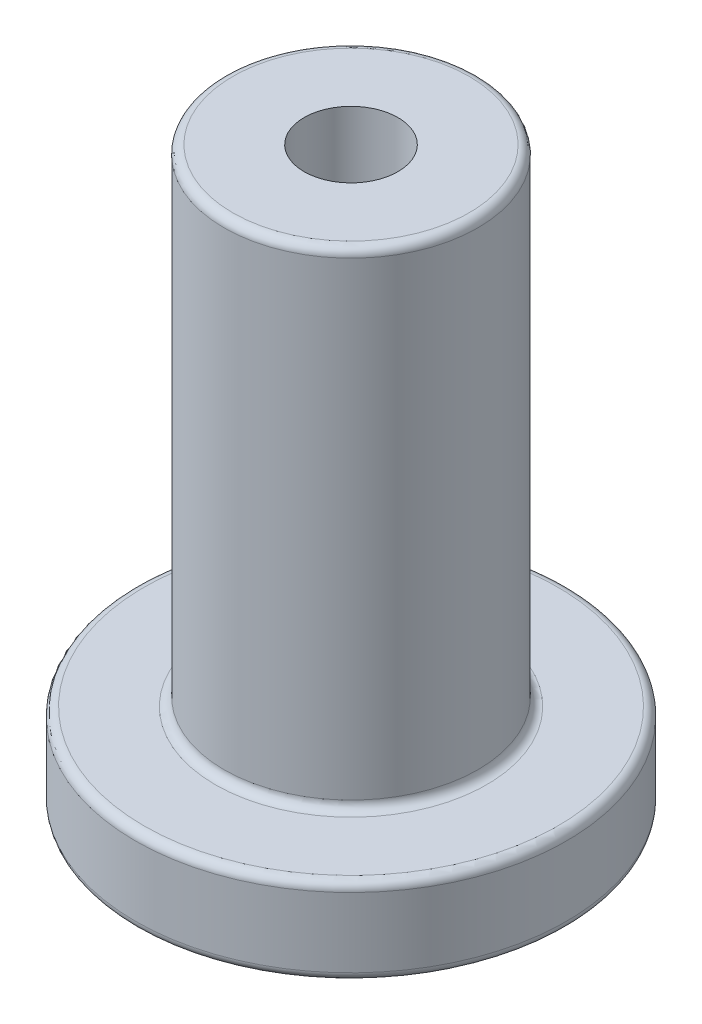
ISO-10303-21;
HEADER;
FILE_DESCRIPTION(('STEP AP214'),'2;1');
FILE_NAME('part.step','',(''),(''),'','','');
FILE_SCHEMA(('AUTOMOTIVE_DESIGN { 1 0 10303 214 1 1 1 1 }'));
ENDSEC;
DATA;
#1=APPLICATION_CONTEXT('core data for automotive mechanical design processes');
#2=APPLICATION_PROTOCOL_DEFINITION('international standard','automotive_design',2000,#1);
#3=PRODUCT_CONTEXT('',#1,'mechanical');
#4=PRODUCT('Part','Part','',(#3));
#5=PRODUCT_RELATED_PRODUCT_CATEGORY('part','',(#4));
#6=PRODUCT_DEFINITION_FORMATION('','',#4);
#7=PRODUCT_DEFINITION_CONTEXT('part definition',#1,'design');
#8=PRODUCT_DEFINITION('design','',#6,#7);
#9=PRODUCT_DEFINITION_SHAPE('','',#8);
#10=(LENGTH_UNIT() NAMED_UNIT(*) SI_UNIT(.MILLI.,.METRE.));
#11=(NAMED_UNIT(*) PLANE_ANGLE_UNIT() SI_UNIT($,.RADIAN.));
#12=(NAMED_UNIT(*) SI_UNIT($,.STERADIAN.) SOLID_ANGLE_UNIT());
#13=UNCERTAINTY_MEASURE_WITH_UNIT(LENGTH_MEASURE(1.E-05),#10,'distance_accuracy_value','');
#14=(GEOMETRIC_REPRESENTATION_CONTEXT(3) GLOBAL_UNCERTAINTY_ASSIGNED_CONTEXT((#13)) GLOBAL_UNIT_ASSIGNED_CONTEXT((#10,
#11,#12)) REPRESENTATION_CONTEXT('',''));
#15=CARTESIAN_POINT('',(0.,0.,0.));
#16=DIRECTION('',(0.,0.,1.));
#17=DIRECTION('',(1.,0.,0.));
#18=AXIS2_PLACEMENT_3D('',#15,#16,#17);
#19=CARTESIAN_POINT('',(0.,0.,0.));
#20=DIRECTION('',(0.,1.,0.));
#21=DIRECTION('',(0.,0.,1.));
#22=AXIS2_PLACEMENT_3D('',#19,#20,#21);
#23=CYLINDRICAL_SURFACE('',#22,2.7);
#24=CARTESIAN_POINT('',(0.,33.,0.));
#25=DIRECTION('',(0.,1.,0.));
#26=DIRECTION('',(0.,0.,1.));
#27=AXIS2_PLACEMENT_3D('',#24,#25,#26);
#28=CIRCLE('',#27,2.7);
#29=CARTESIAN_POINT('',(0.,33.,2.7));
#30=VERTEX_POINT('',#29);
#31=EDGE_CURVE('E144',#30,#30,#28,.T.);
#32=ORIENTED_EDGE('',*,*,#31,.T.);
#33=EDGE_LOOP('',(#32));
#34=FACE_BOUND('',#33,.T.);
#35=CARTESIAN_POINT('',(0.,3.,0.));
#36=DIRECTION('',(0.,-1.,0.));
#37=DIRECTION('',(0.,0.,-1.));
#38=AXIS2_PLACEMENT_3D('',#35,#36,#37);
#39=CIRCLE('',#38,2.7);
#40=CARTESIAN_POINT('',(0.,3.,-2.7));
#41=VERTEX_POINT('',#40);
#42=EDGE_CURVE('E138',#41,#41,#39,.F.);
#43=ORIENTED_EDGE('',*,*,#42,.F.);
#44=EDGE_LOOP('',(#43));
#45=FACE_BOUND('',#44,.T.);
#46=ADVANCED_FACE('F35',(#34,#45),#23,.F.);
#47=CARTESIAN_POINT('',(0.,5.,0.));
#48=DIRECTION('',(0.,-1.,0.));
#49=DIRECTION('',(0.,0.,-1.));
#50=AXIS2_PLACEMENT_3D('',#47,#48,#49);
#51=CYLINDRICAL_SURFACE('',#50,12.4);
#52=CARTESIAN_POINT('',(0.,0.5,0.));
#53=DIRECTION('',(0.,1.,0.));
#54=DIRECTION('',(0.,0.,1.));
#55=AXIS2_PLACEMENT_3D('',#52,#53,#54);
#56=CIRCLE('',#55,12.4);
#57=CARTESIAN_POINT('',(0.,0.5,12.4));
#58=VERTEX_POINT('',#57);
#59=EDGE_CURVE('E152',#58,#58,#56,.T.);
#60=ORIENTED_EDGE('',*,*,#59,.T.);
#61=EDGE_LOOP('',(#60));
#62=FACE_BOUND('',#61,.T.);
#63=CARTESIAN_POINT('',(0.,4.5,0.));
#64=DIRECTION('',(0.,1.,0.));
#65=DIRECTION('',(0.,0.,1.));
#66=AXIS2_PLACEMENT_3D('',#63,#64,#65);
#67=CIRCLE('',#66,12.4);
#68=CARTESIAN_POINT('',(0.,4.5,12.4));
#69=VERTEX_POINT('',#68);
#70=EDGE_CURVE('E147',#69,#69,#67,.F.);
#71=ORIENTED_EDGE('',*,*,#70,.T.);
#72=EDGE_LOOP('',(#71));
#73=FACE_BOUND('',#72,.T.);
#74=ADVANCED_FACE('F181',(#62,#73),#51,.T.);
#75=CARTESIAN_POINT('',(0.,5.,0.));
#76=DIRECTION('',(0.,1.,0.));
#77=DIRECTION('',(0.,0.,1.));
#78=AXIS2_PLACEMENT_3D('',#75,#76,#77);
#79=PLANE('',#78);
#80=CARTESIAN_POINT('',(0.,5.,0.));
#81=DIRECTION('',(0.,1.,0.));
#82=DIRECTION('',(0.,0.,1.));
#83=AXIS2_PLACEMENT_3D('',#80,#81,#82);
#84=CIRCLE('',#83,11.9);
#85=CARTESIAN_POINT('',(0.,5.,11.9));
#86=VERTEX_POINT('',#85);
#87=EDGE_CURVE('E161',#86,#86,#84,.T.);
#88=ORIENTED_EDGE('',*,*,#87,.T.);
#89=EDGE_LOOP('',(#88));
#90=FACE_BOUND('',#89,.T.);
#91=CARTESIAN_POINT('',(0.,5.,0.));
#92=DIRECTION('',(0.,1.,0.));
#93=DIRECTION('',(0.,0.,1.));
#94=AXIS2_PLACEMENT_3D('',#91,#92,#93);
#95=CIRCLE('',#94,7.8);
#96=CARTESIAN_POINT('',(0.,5.,7.8));
#97=VERTEX_POINT('',#96);
#98=EDGE_CURVE('E158',#97,#97,#95,.F.);
#99=ORIENTED_EDGE('',*,*,#98,.T.);
#100=EDGE_LOOP('',(#99));
#101=FACE_BOUND('',#100,.T.);
#102=ADVANCED_FACE('F187',(#90,#101),#79,.T.);
#103=CARTESIAN_POINT('',(0.,0.,0.));
#104=DIRECTION('',(0.,1.,0.));
#105=DIRECTION('',(0.,0.,1.));
#106=AXIS2_PLACEMENT_3D('',#103,#104,#105);
#107=PLANE('',#106);
#108=CARTESIAN_POINT('',(0.,0.,0.));
#109=DIRECTION('',(0.,1.,0.));
#110=DIRECTION('',(0.,0.,1.));
#111=AXIS2_PLACEMENT_3D('',#108,#109,#110);
#112=CIRCLE('',#111,11.9);
#113=CARTESIAN_POINT('',(0.,0.,11.9));
#114=VERTEX_POINT('',#113);
#115=EDGE_CURVE('E155',#114,#114,#112,.F.);
#116=ORIENTED_EDGE('',*,*,#115,.T.);
#117=EDGE_LOOP('',(#116));
#118=FACE_BOUND('',#117,.T.);
#119=DIRECTION('',(0.0798418692045175,0.,-0.996807542067138));
#120=VECTOR('',#119,1.);
#121=CARTESIAN_POINT('',(-4.38019792032887,0.,2.08179398086042));
#122=LINE('',#121,#120);
#123=CARTESIAN_POINT('',(-4.38019792032887,0.,2.08179398086042));
#124=VERTEX_POINT('',#123);
#125=CARTESIAN_POINT('',(-3.99298543303509,0.,-2.75246568217836));
#126=VERTEX_POINT('',#125);
#127=EDGE_CURVE('E125',#124,#126,#122,.T.);
#128=ORIENTED_EDGE('',*,*,#127,.F.);
#129=DIRECTION('',(-0.823339719511808,0.,-0.567548858050315));
#130=VECTOR('',#129,1.);
#131=CARTESIAN_POINT('',(-0.387212487293781,0.,4.83425966303878));
#132=LINE('',#131,#130);
#133=CARTESIAN_POINT('',(-0.387212487293781,0.,4.83425966303878));
#134=VERTEX_POINT('',#133);
#135=EDGE_CURVE('E50',#134,#124,#132,.T.);
#136=ORIENTED_EDGE('',*,*,#135,.F.);
#137=DIRECTION('',(-0.903181588716326,0.,0.429258684016822));
#138=VECTOR('',#137,1.);
#139=CARTESIAN_POINT('',(3.99298543303509,0.,2.75246568217836));
#140=LINE('',#139,#138);
#141=CARTESIAN_POINT('',(3.99298543303509,0.,2.75246568217836));
#142=VERTEX_POINT('',#141);
#143=EDGE_CURVE('E134',#142,#134,#140,.T.);
#144=ORIENTED_EDGE('',*,*,#143,.F.);
#145=DIRECTION('',(-0.0798418692045176,0.,0.996807542067138));
#146=VECTOR('',#145,1.);
#147=CARTESIAN_POINT('',(4.38019792032887,0.,-2.08179398086041));
#148=LINE('',#147,#146);
#149=CARTESIAN_POINT('',(4.38019792032887,0.,-2.08179398086041));
#150=VERTEX_POINT('',#149);
#151=EDGE_CURVE('E132',#150,#142,#148,.T.);
#152=ORIENTED_EDGE('',*,*,#151,.F.);
#153=DIRECTION('',(0.823339719511808,0.,0.567548858050315));
#154=VECTOR('',#153,1.);
#155=CARTESIAN_POINT('',(0.38721248729378,0.,-4.83425966303877));
#156=LINE('',#155,#154);
#157=CARTESIAN_POINT('',(0.38721248729378,0.,-4.83425966303877));
#158=VERTEX_POINT('',#157);
#159=EDGE_CURVE('E98',#158,#150,#156,.T.);
#160=ORIENTED_EDGE('',*,*,#159,.F.);
#161=DIRECTION('',(0.903181588716326,0.,-0.429258684016822));
#162=VECTOR('',#161,1.);
#163=CARTESIAN_POINT('',(-3.99298543303509,0.,-2.75246568217836));
#164=LINE('',#163,#162);
#165=EDGE_CURVE('E128',#126,#158,#164,.T.);
#166=ORIENTED_EDGE('',*,*,#165,.F.);
#167=EDGE_LOOP('',(#128,#136,#144,#152,#160,#166));
#168=FACE_BOUND('',#167,.T.);
#169=ADVANCED_FACE('F201',(#118,#168),#107,.F.);
#170=CARTESIAN_POINT('',(0.,33.,0.));
#171=DIRECTION('',(0.,-1.,0.));
#172=DIRECTION('',(0.,0.,-1.));
#173=AXIS2_PLACEMENT_3D('',#170,#171,#172);
#174=CYLINDRICAL_SURFACE('',#173,7.3);
#175=CARTESIAN_POINT('',(0.,32.5,0.));
#176=DIRECTION('',(0.,1.,0.));
#177=DIRECTION('',(0.,0.,1.));
#178=AXIS2_PLACEMENT_3D('',#175,#176,#177);
#179=CIRCLE('',#178,7.3);
#180=CARTESIAN_POINT('',(0.,32.5,7.3));
#181=VERTEX_POINT('',#180);
#182=EDGE_CURVE('E11',#181,#181,#179,.F.);
#183=ORIENTED_EDGE('',*,*,#182,.T.);
#184=EDGE_LOOP('',(#183));
#185=FACE_BOUND('',#184,.T.);
#186=CARTESIAN_POINT('',(0.,5.5,0.));
#187=DIRECTION('',(0.,1.,0.));
#188=DIRECTION('',(0.,0.,1.));
#189=AXIS2_PLACEMENT_3D('',#186,#187,#188);
#190=CIRCLE('',#189,7.3);
#191=CARTESIAN_POINT('',(0.,5.5,7.3));
#192=VERTEX_POINT('',#191);
#193=EDGE_CURVE('E43',#192,#192,#190,.T.);
#194=ORIENTED_EDGE('',*,*,#193,.T.);
#195=EDGE_LOOP('',(#194));
#196=FACE_BOUND('',#195,.T.);
#197=ADVANCED_FACE('F169',(#185,#196),#174,.T.);
#198=CARTESIAN_POINT('',(0.,33.,0.));
#199=DIRECTION('',(0.,1.,0.));
#200=DIRECTION('',(0.,0.,1.));
#201=AXIS2_PLACEMENT_3D('',#198,#199,#200);
#202=PLANE('',#201);
#203=CARTESIAN_POINT('',(0.,33.,0.));
#204=DIRECTION('',(0.,1.,0.));
#205=DIRECTION('',(0.,0.,1.));
#206=AXIS2_PLACEMENT_3D('',#203,#204,#205);
#207=CIRCLE('',#206,6.8);
#208=CARTESIAN_POINT('',(0.,33.,6.8));
#209=VERTEX_POINT('',#208);
#210=EDGE_CURVE('E164',#209,#209,#207,.T.);
#211=ORIENTED_EDGE('',*,*,#210,.T.);
#212=EDGE_LOOP('',(#211));
#213=FACE_BOUND('',#212,.T.);
#214=ORIENTED_EDGE('',*,*,#31,.F.);
#215=EDGE_LOOP('',(#214));
#216=FACE_BOUND('',#215,.T.);
#217=ADVANCED_FACE('F195',(#213,#216),#202,.T.);
#218=CARTESIAN_POINT('',(0.,3.,0.));
#219=DIRECTION('',(0.,-1.,0.));
#220=DIRECTION('',(0.,0.,-1.));
#221=AXIS2_PLACEMENT_3D('',#218,#219,#220);
#222=PLANE('',#221);
#223=DIRECTION('',(-0.823339719511808,0.,-0.567548858050315));
#224=VECTOR('',#223,1.);
#225=CARTESIAN_POINT('',(-0.387212487293781,3.,4.83425966303878));
#226=LINE('',#225,#224);
#227=CARTESIAN_POINT('',(-0.387212487293781,3.,4.83425966303878));
#228=VERTEX_POINT('',#227);
#229=CARTESIAN_POINT('',(-4.38019792032887,3.,2.08179398086042));
#230=VERTEX_POINT('',#229);
#231=EDGE_CURVE('E136',#228,#230,#226,.T.);
#232=ORIENTED_EDGE('',*,*,#231,.T.);
#233=DIRECTION('',(0.0798418692045175,0.,-0.996807542067138));
#234=VECTOR('',#233,1.);
#235=CARTESIAN_POINT('',(-4.38019792032887,3.,2.08179398086042));
#236=LINE('',#235,#234);
#237=CARTESIAN_POINT('',(-3.99298543303509,3.,-2.75246568217836));
#238=VERTEX_POINT('',#237);
#239=EDGE_CURVE('E119',#230,#238,#236,.T.);
#240=ORIENTED_EDGE('',*,*,#239,.T.);
#241=DIRECTION('',(0.903181588716326,0.,-0.429258684016822));
#242=VECTOR('',#241,1.);
#243=CARTESIAN_POINT('',(-3.99298543303509,3.,-2.75246568217836));
#244=LINE('',#243,#242);
#245=CARTESIAN_POINT('',(0.38721248729378,3.,-4.83425966303877));
#246=VERTEX_POINT('',#245);
#247=EDGE_CURVE('E117',#238,#246,#244,.T.);
#248=ORIENTED_EDGE('',*,*,#247,.T.);
#249=DIRECTION('',(0.823339719511808,0.,0.567548858050315));
#250=VECTOR('',#249,1.);
#251=CARTESIAN_POINT('',(0.38721248729378,3.,-4.83425966303877));
#252=LINE('',#251,#250);
#253=CARTESIAN_POINT('',(4.38019792032887,3.,-2.08179398086041));
#254=VERTEX_POINT('',#253);
#255=EDGE_CURVE('E95',#246,#254,#252,.T.);
#256=ORIENTED_EDGE('',*,*,#255,.T.);
#257=DIRECTION('',(-0.0798418692045176,0.,0.996807542067138));
#258=VECTOR('',#257,1.);
#259=CARTESIAN_POINT('',(4.38019792032887,3.,-2.08179398086041));
#260=LINE('',#259,#258);
#261=CARTESIAN_POINT('',(3.99298543303509,3.,2.75246568217836));
#262=VERTEX_POINT('',#261);
#263=EDGE_CURVE('E106',#254,#262,#260,.T.);
#264=ORIENTED_EDGE('',*,*,#263,.T.);
#265=DIRECTION('',(-0.903181588716326,0.,0.429258684016822));
#266=VECTOR('',#265,1.);
#267=CARTESIAN_POINT('',(3.99298543303509,3.,2.75246568217836));
#268=LINE('',#267,#266);
#269=EDGE_CURVE('E110',#262,#228,#268,.T.);
#270=ORIENTED_EDGE('',*,*,#269,.T.);
#271=EDGE_LOOP('',(#232,#240,#248,#256,#264,#270));
#272=FACE_BOUND('',#271,.T.);
#273=ORIENTED_EDGE('',*,*,#42,.T.);
#274=EDGE_LOOP('',(#273));
#275=FACE_BOUND('',#274,.T.);
#276=ADVANCED_FACE('F113',(#272,#275),#222,.T.);
#277=CARTESIAN_POINT('',(-0.387212487293781,3.,4.83425966303878));
#278=DIRECTION('',(-0.567548858050315,0.,0.823339719511808));
#279=DIRECTION('',(0.823339719511808,0.,0.567548858050315));
#280=AXIS2_PLACEMENT_3D('',#277,#278,#279);
#281=PLANE('',#280);
#282=ORIENTED_EDGE('',*,*,#135,.T.);
#283=DIRECTION('',(0.,-1.,0.));
#284=VECTOR('',#283,1.);
#285=CARTESIAN_POINT('',(-4.38019792032887,3.,2.08179398086042));
#286=LINE('',#285,#284);
#287=EDGE_CURVE('E80',#230,#124,#286,.T.);
#288=ORIENTED_EDGE('',*,*,#287,.F.);
#289=ORIENTED_EDGE('',*,*,#231,.F.);
#290=DIRECTION('',(0.,-1.,0.));
#291=VECTOR('',#290,1.);
#292=CARTESIAN_POINT('',(-0.387212487293781,3.,4.83425966303878));
#293=LINE('',#292,#291);
#294=EDGE_CURVE('E58',#228,#134,#293,.T.);
#295=ORIENTED_EDGE('',*,*,#294,.T.);
#296=EDGE_LOOP('',(#282,#288,#289,#295));
#297=FACE_BOUND('',#296,.T.);
#298=ADVANCED_FACE('F193',(#297),#281,.F.);
#299=CARTESIAN_POINT('',(3.99298543303509,3.,2.75246568217836));
#300=DIRECTION('',(0.429258684016822,0.,0.903181588716325));
#301=DIRECTION('',(0.903181588716326,0.,-0.429258684016822));
#302=AXIS2_PLACEMENT_3D('',#299,#300,#301);
#303=PLANE('',#302);
#304=ORIENTED_EDGE('',*,*,#143,.T.);
#305=ORIENTED_EDGE('',*,*,#294,.F.);
#306=ORIENTED_EDGE('',*,*,#269,.F.);
#307=DIRECTION('',(0.,-1.,0.));
#308=VECTOR('',#307,1.);
#309=CARTESIAN_POINT('',(3.99298543303509,3.,2.75246568217836));
#310=LINE('',#309,#308);
#311=EDGE_CURVE('E102',#262,#142,#310,.T.);
#312=ORIENTED_EDGE('',*,*,#311,.T.);
#313=EDGE_LOOP('',(#304,#305,#306,#312));
#314=FACE_BOUND('',#313,.T.);
#315=ADVANCED_FACE('F274',(#314),#303,.F.);
#316=CARTESIAN_POINT('',(4.38019792032887,3.,-2.08179398086041));
#317=DIRECTION('',(0.996807542067138,0.,0.0798418692045176));
#318=DIRECTION('',(0.0798418692045176,0.,-0.996807542067138));
#319=AXIS2_PLACEMENT_3D('',#316,#317,#318);
#320=PLANE('',#319);
#321=ORIENTED_EDGE('',*,*,#151,.T.);
#322=ORIENTED_EDGE('',*,*,#311,.F.);
#323=ORIENTED_EDGE('',*,*,#263,.F.);
#324=DIRECTION('',(0.,-1.,0.));
#325=VECTOR('',#324,1.);
#326=CARTESIAN_POINT('',(4.38019792032887,3.,-2.08179398086041));
#327=LINE('',#326,#325);
#328=EDGE_CURVE('E91',#254,#150,#327,.T.);
#329=ORIENTED_EDGE('',*,*,#328,.T.);
#330=EDGE_LOOP('',(#321,#322,#323,#329));
#331=FACE_BOUND('',#330,.T.);
#332=ADVANCED_FACE('F107',(#331),#320,.F.);
#333=CARTESIAN_POINT('',(0.38721248729378,3.,-4.83425966303877));
#334=DIRECTION('',(0.567548858050315,0.,-0.823339719511808));
#335=DIRECTION('',(-0.823339719511808,0.,-0.567548858050316));
#336=AXIS2_PLACEMENT_3D('',#333,#334,#335);
#337=PLANE('',#336);
#338=ORIENTED_EDGE('',*,*,#159,.T.);
#339=ORIENTED_EDGE('',*,*,#328,.F.);
#340=ORIENTED_EDGE('',*,*,#255,.F.);
#341=DIRECTION('',(0.,-1.,0.));
#342=VECTOR('',#341,1.);
#343=CARTESIAN_POINT('',(0.38721248729378,3.,-4.83425966303877));
#344=LINE('',#343,#342);
#345=EDGE_CURVE('E103',#246,#158,#344,.T.);
#346=ORIENTED_EDGE('',*,*,#345,.T.);
#347=EDGE_LOOP('',(#338,#339,#340,#346));
#348=FACE_BOUND('',#347,.T.);
#349=ADVANCED_FACE('F93',(#348),#337,.F.);
#350=CARTESIAN_POINT('',(-3.99298543303509,3.,-2.75246568217836));
#351=DIRECTION('',(-0.429258684016822,0.,-0.903181588716326));
#352=DIRECTION('',(-0.903181588716326,0.,0.429258684016822));
#353=AXIS2_PLACEMENT_3D('',#350,#351,#352);
#354=PLANE('',#353);
#355=ORIENTED_EDGE('',*,*,#165,.T.);
#356=ORIENTED_EDGE('',*,*,#345,.F.);
#357=ORIENTED_EDGE('',*,*,#247,.F.);
#358=DIRECTION('',(0.,-1.,0.));
#359=VECTOR('',#358,1.);
#360=CARTESIAN_POINT('',(-3.99298543303509,3.,-2.75246568217836));
#361=LINE('',#360,#359);
#362=EDGE_CURVE('E141',#238,#126,#361,.T.);
#363=ORIENTED_EDGE('',*,*,#362,.T.);
#364=EDGE_LOOP('',(#355,#356,#357,#363));
#365=FACE_BOUND('',#364,.T.);
#366=ADVANCED_FACE('F250',(#365),#354,.F.);
#367=CARTESIAN_POINT('',(-4.38019792032887,3.,2.08179398086042));
#368=DIRECTION('',(-0.996807542067138,0.,-0.0798418692045175));
#369=DIRECTION('',(-0.0798418692045175,0.,0.996807542067138));
#370=AXIS2_PLACEMENT_3D('',#367,#368,#369);
#371=PLANE('',#370);
#372=ORIENTED_EDGE('',*,*,#127,.T.);
#373=ORIENTED_EDGE('',*,*,#362,.F.);
#374=ORIENTED_EDGE('',*,*,#239,.F.);
#375=ORIENTED_EDGE('',*,*,#287,.T.);
#376=EDGE_LOOP('',(#372,#373,#374,#375));
#377=FACE_BOUND('',#376,.T.);
#378=ADVANCED_FACE('F212',(#377),#371,.F.);
#379=CARTESIAN_POINT('',(0.,0.5,0.));
#380=DIRECTION('',(0.,1.,0.));
#381=DIRECTION('',(0.,0.,1.));
#382=AXIS2_PLACEMENT_3D('',#379,#380,#381);
#383=TOROIDAL_SURFACE('',#382,11.9,0.5);
#384=ORIENTED_EDGE('',*,*,#115,.F.);
#385=EDGE_LOOP('',(#384));
#386=FACE_BOUND('',#385,.T.);
#387=ORIENTED_EDGE('',*,*,#59,.F.);
#388=EDGE_LOOP('',(#387));
#389=FACE_BOUND('',#388,.T.);
#390=ADVANCED_FACE('F209',(#386,#389),#383,.T.);
#391=CARTESIAN_POINT('',(0.,4.5,0.));
#392=DIRECTION('',(0.,1.,0.));
#393=DIRECTION('',(0.,0.,1.));
#394=AXIS2_PLACEMENT_3D('',#391,#392,#393);
#395=TOROIDAL_SURFACE('',#394,11.9,0.5);
#396=ORIENTED_EDGE('',*,*,#70,.F.);
#397=EDGE_LOOP('',(#396));
#398=FACE_BOUND('',#397,.T.);
#399=ORIENTED_EDGE('',*,*,#87,.F.);
#400=EDGE_LOOP('',(#399));
#401=FACE_BOUND('',#400,.T.);
#402=ADVANCED_FACE('F177',(#398,#401),#395,.T.);
#403=CARTESIAN_POINT('',(0.,32.5,0.));
#404=DIRECTION('',(0.,1.,0.));
#405=DIRECTION('',(0.,0.,1.));
#406=AXIS2_PLACEMENT_3D('',#403,#404,#405);
#407=TOROIDAL_SURFACE('',#406,6.8,0.5);
#408=ORIENTED_EDGE('',*,*,#182,.F.);
#409=EDGE_LOOP('',(#408));
#410=FACE_BOUND('',#409,.T.);
#411=ORIENTED_EDGE('',*,*,#210,.F.);
#412=EDGE_LOOP('',(#411));
#413=FACE_BOUND('',#412,.T.);
#414=ADVANCED_FACE('F172',(#410,#413),#407,.T.);
#415=CARTESIAN_POINT('',(0.,5.5,0.));
#416=DIRECTION('',(0.,1.,0.));
#417=DIRECTION('',(0.,0.,1.));
#418=AXIS2_PLACEMENT_3D('',#415,#416,#417);
#419=TOROIDAL_SURFACE('',#418,7.8,0.5);
#420=ORIENTED_EDGE('',*,*,#98,.F.);
#421=EDGE_LOOP('',(#420));
#422=FACE_BOUND('',#421,.T.);
#423=ORIENTED_EDGE('',*,*,#193,.F.);
#424=EDGE_LOOP('',(#423));
#425=FACE_BOUND('',#424,.T.);
#426=ADVANCED_FACE('F37',(#422,#425),#419,.F.);
#427=CLOSED_SHELL('',(#46,#74,#102,#169,#197,#217,#276,#298,#315,#332,#349,#366,#378,#390,#402,
#414,#426));
#428=MANIFOLD_SOLID_BREP('B2',#427);
#429=ADVANCED_BREP_SHAPE_REPRESENTATION('',(#18,#428),#14);
#430=SHAPE_DEFINITION_REPRESENTATION(#9,#429);
ENDSEC;
END-ISO-10303-21;
